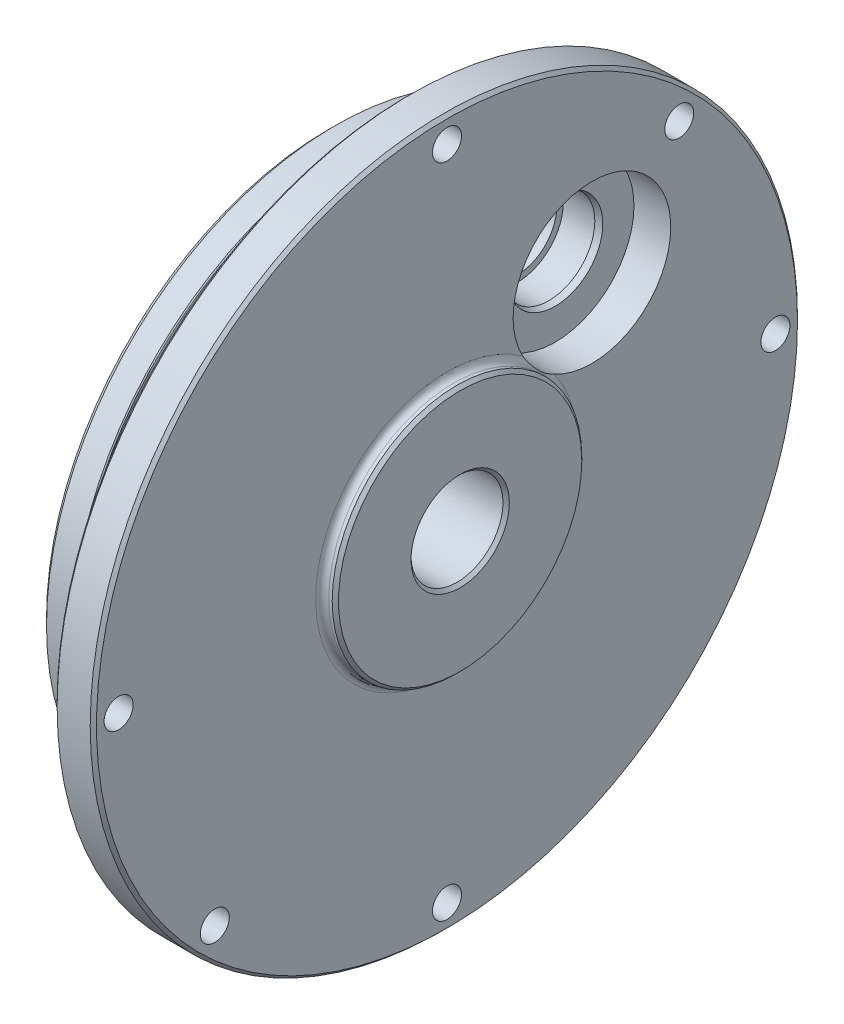
ISO-10303-21;
HEADER;
FILE_DESCRIPTION(('STEP AP214'),'2;1');
FILE_NAME('part.step','',(''),(''),'','','');
FILE_SCHEMA(('AUTOMOTIVE_DESIGN { 1 0 10303 214 1 1 1 1 }'));
ENDSEC;
DATA;
#1=APPLICATION_CONTEXT('core data for automotive mechanical design processes');
#2=APPLICATION_PROTOCOL_DEFINITION('international standard','automotive_design',2000,#1);
#3=PRODUCT_CONTEXT('',#1,'mechanical');
#4=PRODUCT('Part','Part','',(#3));
#5=PRODUCT_RELATED_PRODUCT_CATEGORY('part','',(#4));
#6=PRODUCT_DEFINITION_FORMATION('','',#4);
#7=PRODUCT_DEFINITION_CONTEXT('part definition',#1,'design');
#8=PRODUCT_DEFINITION('design','',#6,#7);
#9=PRODUCT_DEFINITION_SHAPE('','',#8);
#10=(LENGTH_UNIT() NAMED_UNIT(*) SI_UNIT(.MILLI.,.METRE.));
#11=(NAMED_UNIT(*) PLANE_ANGLE_UNIT() SI_UNIT($,.RADIAN.));
#12=(NAMED_UNIT(*) SI_UNIT($,.STERADIAN.) SOLID_ANGLE_UNIT());
#13=UNCERTAINTY_MEASURE_WITH_UNIT(LENGTH_MEASURE(1.E-05),#10,'distance_accuracy_value','');
#14=(GEOMETRIC_REPRESENTATION_CONTEXT(3) GLOBAL_UNCERTAINTY_ASSIGNED_CONTEXT((#13)) GLOBAL_UNIT_ASSIGNED_CONTEXT((#10,
#11,#12)) REPRESENTATION_CONTEXT('',''));
#15=CARTESIAN_POINT('',(0.,0.,0.));
#16=DIRECTION('',(0.,0.,1.));
#17=DIRECTION('',(1.,0.,0.));
#18=AXIS2_PLACEMENT_3D('',#15,#16,#17);
#19=CARTESIAN_POINT('',(15.0749,0.,0.));
#20=DIRECTION('',(-1.,0.,0.));
#21=DIRECTION('',(0.,0.,1.));
#22=AXIS2_PLACEMENT_3D('',#19,#20,#21);
#23=TOROIDAL_SURFACE('',#22,15.86865,0.787400000000001);
#24=CARTESIAN_POINT('',(14.6009713913926,14.057150981017,-8.63495158509178));
#25=CARTESIAN_POINT('',(14.5798328205629,14.0325601259822,-8.64451922023028));
#26=CARTESIAN_POINT('',(14.5601640850397,14.0069828588835,-8.65459249576202));
#27=CARTESIAN_POINT('',(14.5235663697186,13.9543684369931,-8.67559332817284));
#28=CARTESIAN_POINT('',(14.5066303073722,13.9273353065076,-8.6865185641289));
#29=CARTESIAN_POINT('',(14.4598444125726,13.8452730351948,-8.72014783666078));
#30=CARTESIAN_POINT('',(14.4335256889049,13.7886734351264,-8.74393988788284));
#31=CARTESIAN_POINT('',(14.3925838300565,13.683491745751,-8.78941863311359));
#32=CARTESIAN_POINT('',(14.3767256686702,13.6352138480182,-8.81075893789654));
#33=CARTESIAN_POINT('',(14.3494997786954,13.5379705491488,-8.85473686771231));
#34=CARTESIAN_POINT('',(14.338133942262,13.489004867292,-8.87737503481422));
#35=CARTESIAN_POINT('',(14.3191460129198,13.3905416611305,-8.92393158266425));
#36=CARTESIAN_POINT('',(14.3115509541403,13.3410428241516,-8.94785788240117));
#37=CARTESIAN_POINT('',(14.2996380478389,13.2421722083815,-8.99671750456705));
#38=CARTESIAN_POINT('',(14.2953195903333,13.1928004076473,-9.02165063864947));
#39=CARTESIAN_POINT('',(14.2884756519894,13.0777691381543,-9.08101051042028));
#40=CARTESIAN_POINT('',(14.2870465609021,13.012234025526,-9.11580229519625));
#41=CARTESIAN_POINT('',(14.2881964861084,12.8820126826089,-9.18689801701797));
#42=CARTESIAN_POINT('',(14.2907773178194,12.8173268501878,-9.22320263172653));
#43=CARTESIAN_POINT('',(14.3033309432579,12.6246259712907,-9.33433054572981));
#44=CARTESIAN_POINT('',(14.3181209607771,12.4981490403844,-9.41127420571426));
#45=CARTESIAN_POINT('',(14.3554365825578,12.2492781348233,-9.57067959387512));
#46=CARTESIAN_POINT('',(14.3779950326898,12.1269039578394,-9.6531635353199));
#47=CARTESIAN_POINT('',(14.42631933359,11.8866082790783,-9.82333399299739));
#48=CARTESIAN_POINT('',(14.4520834308695,11.7686843886053,-9.91101765136592));
#49=CARTESIAN_POINT('',(14.4981767253612,11.5541672915491,-10.0783675273379));
#50=CARTESIAN_POINT('',(14.5187418104788,11.4570256563188,-10.1572662320137));
#51=CARTESIAN_POINT('',(14.55491725739,11.2653669944242,-10.3193383585005));
#52=CARTESIAN_POINT('',(14.570529000432,11.1708492428053,-10.402510581103));
#53=CARTESIAN_POINT('',(14.5872727706871,11.0313630524024,-10.5302808112137));
#54=CARTESIAN_POINT('',(14.591739453759,10.9853374231413,-10.5732856078839));
#55=CARTESIAN_POINT('',(14.598123632286,10.8940595672357,-10.6602887087338));
#56=CARTESIAN_POINT('',(14.6000414534541,10.8488072425022,-10.704286885241));
#57=CARTESIAN_POINT('',(14.6011557585968,10.7592043443387,-10.7931577972775));
#58=CARTESIAN_POINT('',(14.6003543613644,10.7148530958946,-10.8380298248133));
#59=CARTESIAN_POINT('',(14.5961111073705,10.6271132802999,-10.9285800275613));
#60=CARTESIAN_POINT('',(14.5926691779609,10.5837247396697,-10.9742582249196));
#61=CARTESIAN_POINT('',(14.5796520990526,10.463055295274,-11.1038408927238));
#62=CARTESIAN_POINT('',(14.5673648105531,10.3869564359335,-11.1885743554332));
#63=CARTESIAN_POINT('',(14.5377420511546,10.2382471534765,-11.3602114745736));
#64=CARTESIAN_POINT('',(14.5204033416081,10.1656390032814,-11.447116490483));
#65=CARTESIAN_POINT('',(14.483479958148,10.0234192917324,-11.6236145103684));
#66=CARTESIAN_POINT('',(14.4638842658066,9.95382492859865,-11.7132189757313));
#67=CARTESIAN_POINT('',(14.4249994307004,9.81787195278367,-11.8948647592938));
#68=CARTESIAN_POINT('',(14.4057101798704,9.75151218156105,-11.9869051865009));
#69=CARTESIAN_POINT('',(14.3696572250397,9.62215918891481,-12.1732649120658));
#70=CARTESIAN_POINT('',(14.3528837798405,9.55915362568563,-12.2675736888158));
#71=CARTESIAN_POINT('',(14.3238255819636,9.43620207038486,-12.4589619937246));
#72=CARTESIAN_POINT('',(14.3115436042011,9.37625798936291,-12.5560431949499));
#73=CARTESIAN_POINT('',(14.2938225653538,9.25999304331051,-12.7521733471521));
#74=CARTESIAN_POINT('',(14.2883411576726,9.20365184977508,-12.8512061798053));
#75=CARTESIAN_POINT('',(14.2868348809177,9.09456756987707,-13.0512525533553));
#76=CARTESIAN_POINT('',(14.290794532487,9.04181873944248,-13.1522625831038));
#77=CARTESIAN_POINT('',(14.3055259137087,8.97102109625781,-13.2939295040689));
#78=CARTESIAN_POINT('',(14.3107584300347,8.95120759522785,-13.3342948221256));
#79=CARTESIAN_POINT('',(14.3236213301597,8.91228792381575,-13.4150141433357));
#80=CARTESIAN_POINT('',(14.331252713665,8.89318205204917,-13.4553681347386));
#81=CARTESIAN_POINT('',(14.3492196962482,8.8558460251228,-13.5356675234641));
#82=CARTESIAN_POINT('',(14.3595432535807,8.83761238786049,-13.5756139372596));
#83=CARTESIAN_POINT('',(14.3833061963218,8.80204149848154,-13.6549644442772));
#84=CARTESIAN_POINT('',(14.3967451645059,8.78470412671443,-13.6943686093707));
#85=CARTESIAN_POINT('',(14.4343642157095,8.74315033710193,-13.7905402716815));
#86=CARTESIAN_POINT('',(14.4606269882049,8.71951535797588,-13.846795976134));
#87=CARTESIAN_POINT('',(14.5072321524085,8.68612244668942,-13.9283126451251));
#88=CARTESIAN_POINT('',(14.5240753476179,8.67528404792033,-13.9551384089124));
#89=CARTESIAN_POINT('',(14.5604486926939,8.65444676615417,-14.0073530119022));
#90=CARTESIAN_POINT('',(14.5799855473927,8.64445008154354,-14.0327380351207));
#91=CARTESIAN_POINT('',(14.6009713913925,8.63495158509171,-14.057150981017));
#92=B_SPLINE_CURVE_WITH_KNOTS('',3,(#24,#25,#26,#27,#28,#29,#30,#31,#32,#33,#34,#35,#36,#37,#38,
#39,#40,#41,#42,#43,#44,#45,#46,#47,#48,#49,#50,#51,#52,#53,#54,#55,#56,#57,#58,#59,#60,#61,#62,
#63,#64,#65,#66,#67,#68,#69,#70,#71,#72,#73,#74,#75,#76,#77,#78,#79,#80,#81,#82,#83,#84,#85,#86,
#87,#88,#89,#90,#91),.UNSPECIFIED.,.F.,.F.,(4,2,2,2,2,2,2,2,2,2,2,2,2,2,2,2,2,2,2,2,2,2,2,2,2,2,
2,2,2,2,2,2,2,4),(0.,0.101289256968871,0.20231162225604,0.401942154814138,0.56708410007827,
0.732295528749304,0.898674906691825,1.06502330325715,1.28749169649923,1.51006083748491,
1.95580914411644,2.40346575079253,2.85087855707354,3.23124685067497,3.61150898446447,
3.80089870646978,3.99026422448824,4.17948222431273,4.36870543020958,4.71206622085314,
5.05564763871081,5.400983810968,5.7461953705154,6.09003370528295,6.4340841125403,
6.77598121484699,7.11731813561848,7.25307152632723,7.38888156621041,7.52409426472,
7.65928886561703,7.85780557789531,7.95810844732447,8.05866564777033),.UNSPECIFIED.);
#93=CARTESIAN_POINT('',(14.2875,12.9745918725434,-9.13641168968601));
#94=VERTEX_POINT('',#93);
#95=CARTESIAN_POINT('',(14.2875,9.13641168968597,-12.9745918725434));
#96=VERTEX_POINT('',#95);
#97=EDGE_CURVE('E55',#94,#96,#92,.T.);
#98=ORIENTED_EDGE('',*,*,#97,.F.);
#99=CARTESIAN_POINT('',(14.2875,0.,0.));
#100=DIRECTION('',(-1.,0.,0.));
#101=DIRECTION('',(0.,0.,1.));
#102=AXIS2_PLACEMENT_3D('',#99,#100,#101);
#103=CIRCLE('',#102,15.86865);
#104=EDGE_CURVE('E65',#96,#94,#103,.T.);
#105=ORIENTED_EDGE('',*,*,#104,.F.);
#106=EDGE_LOOP('',(#98,#105));
#107=FACE_BOUND('',#106,.T.);
#108=CARTESIAN_POINT('',(15.0749,0.,0.));
#109=DIRECTION('',(1.,0.,0.));
#110=DIRECTION('',(0.,0.,-1.));
#111=AXIS2_PLACEMENT_3D('',#108,#109,#110);
#112=CIRCLE('',#111,15.08125);
#113=CARTESIAN_POINT('',(15.0749,0.,-15.08125));
#114=VERTEX_POINT('',#113);
#115=EDGE_CURVE('E611',#114,#114,#112,.T.);
#116=ORIENTED_EDGE('',*,*,#115,.F.);
#117=EDGE_LOOP('',(#116));
#118=FACE_BOUND('',#117,.T.);
#119=ADVANCED_FACE('F38',(#107,#118),#23,.F.);
#120=CARTESIAN_POINT('',(14.2875,42.7355,0.));
#121=DIRECTION('',(1.,0.,0.));
#122=DIRECTION('',(0.,0.,-1.));
#123=AXIS2_PLACEMENT_3D('',#120,#121,#122);
#124=PLANE('',#123);
#125=CARTESIAN_POINT('',(14.2875,0.,0.));
#126=DIRECTION('',(1.,0.,0.));
#127=DIRECTION('',(0.,0.,-1.));
#128=AXIS2_PLACEMENT_3D('',#125,#126,#127);
#129=CIRCLE('',#128,42.3545);
#130=CARTESIAN_POINT('',(14.2875,0.,-42.3545));
#131=VERTEX_POINT('',#130);
#132=EDGE_CURVE('E118',#131,#131,#129,.T.);
#133=ORIENTED_EDGE('',*,*,#132,.T.);
#134=EDGE_LOOP('',(#133));
#135=FACE_BOUND('',#134,.T.);
#136=CARTESIAN_POINT('',(14.2875,-28.0633003783411,28.0633003783412));
#137=DIRECTION('',(1.,0.,0.));
#138=DIRECTION('',(0.,0.,-1.));
#139=AXIS2_PLACEMENT_3D('',#136,#137,#138);
#140=CIRCLE('',#139,1.75259999999999);
#141=CARTESIAN_POINT('',(14.2875,-28.0633003783411,26.3107003783412));
#142=VERTEX_POINT('',#141);
#143=EDGE_CURVE('E85',#142,#142,#140,.T.);
#144=ORIENTED_EDGE('',*,*,#143,.F.);
#145=EDGE_LOOP('',(#144));
#146=FACE_BOUND('',#145,.T.);
#147=CARTESIAN_POINT('',(14.2875,28.0633003783411,-28.0633003783412));
#148=DIRECTION('',(1.,0.,0.));
#149=DIRECTION('',(0.,0.,-1.));
#150=AXIS2_PLACEMENT_3D('',#147,#148,#149);
#151=CIRCLE('',#150,1.75259999999999);
#152=CARTESIAN_POINT('',(14.2875,28.0633003783411,-29.8159003783411));
#153=VERTEX_POINT('',#152);
#154=EDGE_CURVE('E283',#153,#153,#151,.T.);
#155=ORIENTED_EDGE('',*,*,#154,.F.);
#156=EDGE_LOOP('',(#155));
#157=FACE_BOUND('',#156,.T.);
#158=CARTESIAN_POINT('',(14.2875,0.,39.6875));
#159=DIRECTION('',(1.,0.,0.));
#160=DIRECTION('',(0.,0.,-1.));
#161=AXIS2_PLACEMENT_3D('',#158,#159,#160);
#162=CIRCLE('',#161,1.75259999999999);
#163=CARTESIAN_POINT('',(14.2875,0.,37.9349));
#164=VERTEX_POINT('',#163);
#165=EDGE_CURVE('E287',#164,#164,#162,.T.);
#166=ORIENTED_EDGE('',*,*,#165,.F.);
#167=EDGE_LOOP('',(#166));
#168=FACE_BOUND('',#167,.T.);
#169=CARTESIAN_POINT('',(14.2875,0.,-39.6875));
#170=DIRECTION('',(1.,0.,0.));
#171=DIRECTION('',(0.,0.,-1.));
#172=AXIS2_PLACEMENT_3D('',#169,#170,#171);
#173=CIRCLE('',#172,1.75259999999999);
#174=CARTESIAN_POINT('',(14.2875,0.,-41.4401));
#175=VERTEX_POINT('',#174);
#176=EDGE_CURVE('E291',#175,#175,#173,.T.);
#177=ORIENTED_EDGE('',*,*,#176,.F.);
#178=EDGE_LOOP('',(#177));
#179=FACE_BOUND('',#178,.T.);
#180=CARTESIAN_POINT('',(14.2875,-39.6875,0.));
#181=DIRECTION('',(1.,0.,0.));
#182=DIRECTION('',(0.,0.,-1.));
#183=AXIS2_PLACEMENT_3D('',#180,#181,#182);
#184=CIRCLE('',#183,1.75259999999999);
#185=CARTESIAN_POINT('',(14.2875,-39.6875,-1.75259999999999));
#186=VERTEX_POINT('',#185);
#187=EDGE_CURVE('E295',#186,#186,#184,.T.);
#188=ORIENTED_EDGE('',*,*,#187,.F.);
#189=EDGE_LOOP('',(#188));
#190=FACE_BOUND('',#189,.T.);
#191=CARTESIAN_POINT('',(14.2875,39.6875,0.));
#192=DIRECTION('',(1.,0.,0.));
#193=DIRECTION('',(0.,0.,-1.));
#194=AXIS2_PLACEMENT_3D('',#191,#192,#193);
#195=CIRCLE('',#194,1.75259999999999);
#196=CARTESIAN_POINT('',(14.2875,39.6875,-1.75259999999999));
#197=VERTEX_POINT('',#196);
#198=EDGE_CURVE('E298',#197,#197,#195,.T.);
#199=ORIENTED_EDGE('',*,*,#198,.F.);
#200=EDGE_LOOP('',(#199));
#201=FACE_BOUND('',#200,.T.);
#202=CARTESIAN_POINT('',(14.2875,17.5114994360848,-17.5114994360849));
#203=DIRECTION('',(1.,0.,0.));
#204=DIRECTION('',(0.,0.,-1.));
#205=AXIS2_PLACEMENT_3D('',#202,#203,#204);
#206=CIRCLE('',#205,9.525);
#207=EDGE_CURVE('E57',#96,#94,#206,.T.);
#208=ORIENTED_EDGE('',*,*,#207,.F.);
#209=ORIENTED_EDGE('',*,*,#104,.T.);
#210=EDGE_LOOP('',(#208,#209));
#211=FACE_BOUND('',#210,.T.);
#212=ADVANCED_FACE('F73',(#135,#146,#157,#168,#179,#190,#201,#211),#124,.T.);
#213=CARTESIAN_POINT('',(15.074925,0.,0.));
#214=DIRECTION('',(-1.,0.,0.));
#215=DIRECTION('',(0.,0.,1.));
#216=AXIS2_PLACEMENT_3D('',#213,#214,#215);
#217=CYLINDRICAL_SURFACE('',#216,42.7355);
#218=CARTESIAN_POINT('',(9.90600000000006,0.,0.));
#219=DIRECTION('',(-1.,0.,0.));
#220=DIRECTION('',(0.,0.,1.));
#221=AXIS2_PLACEMENT_3D('',#218,#219,#220);
#222=CIRCLE('',#221,42.7355);
#223=CARTESIAN_POINT('',(9.90600000000006,0.,42.7355));
#224=VERTEX_POINT('',#223);
#225=EDGE_CURVE('E110',#224,#224,#222,.F.);
#226=ORIENTED_EDGE('',*,*,#225,.T.);
#227=EDGE_LOOP('',(#226));
#228=FACE_BOUND('',#227,.T.);
#229=CARTESIAN_POINT('',(13.9064999999999,0.,0.));
#230=DIRECTION('',(1.,0.,0.));
#231=DIRECTION('',(0.,0.,-1.));
#232=AXIS2_PLACEMENT_3D('',#229,#230,#231);
#233=CIRCLE('',#232,42.7355);
#234=CARTESIAN_POINT('',(13.9064999999999,0.,-42.7355));
#235=VERTEX_POINT('',#234);
#236=EDGE_CURVE('E106',#235,#235,#233,.F.);
#237=ORIENTED_EDGE('',*,*,#236,.T.);
#238=EDGE_LOOP('',(#237));
#239=FACE_BOUND('',#238,.T.);
#240=ADVANCED_FACE('F267',(#228,#239),#217,.T.);
#241=CARTESIAN_POINT('',(9.525,34.8996,0.));
#242=DIRECTION('',(-1.,0.,0.));
#243=DIRECTION('',(0.,0.,1.));
#244=AXIS2_PLACEMENT_3D('',#241,#242,#243);
#245=PLANE('',#244);
#246=CARTESIAN_POINT('',(9.525,0.,0.));
#247=DIRECTION('',(-1.,0.,0.));
#248=DIRECTION('',(0.,0.,1.));
#249=AXIS2_PLACEMENT_3D('',#246,#247,#248);
#250=CIRCLE('',#249,42.3544999999999);
#251=CARTESIAN_POINT('',(9.525,0.,42.3544999999999));
#252=VERTEX_POINT('',#251);
#253=EDGE_CURVE('E102',#252,#252,#250,.T.);
#254=ORIENTED_EDGE('',*,*,#253,.T.);
#255=EDGE_LOOP('',(#254));
#256=FACE_BOUND('',#255,.T.);
#257=CARTESIAN_POINT('',(9.52499999999999,-28.0633003783411,28.0633003783412));
#258=DIRECTION('',(-1.,0.,0.));
#259=DIRECTION('',(0.,0.,1.));
#260=AXIS2_PLACEMENT_3D('',#257,#258,#259);
#261=CIRCLE('',#260,1.75259999999999);
#262=CARTESIAN_POINT('',(9.52499999999999,-28.0633003783411,29.8159003783411));
#263=VERTEX_POINT('',#262);
#264=EDGE_CURVE('E90',#263,#263,#261,.T.);
#265=ORIENTED_EDGE('',*,*,#264,.F.);
#266=EDGE_LOOP('',(#265));
#267=FACE_BOUND('',#266,.T.);
#268=CARTESIAN_POINT('',(9.52499999999999,28.0633003783411,-28.0633003783412));
#269=DIRECTION('',(-1.,0.,0.));
#270=DIRECTION('',(0.,0.,1.));
#271=AXIS2_PLACEMENT_3D('',#268,#269,#270);
#272=CIRCLE('',#271,1.75259999999999);
#273=CARTESIAN_POINT('',(9.52499999999999,28.0633003783411,-26.3107003783412));
#274=VERTEX_POINT('',#273);
#275=EDGE_CURVE('E89',#274,#274,#272,.T.);
#276=ORIENTED_EDGE('',*,*,#275,.F.);
#277=EDGE_LOOP('',(#276));
#278=FACE_BOUND('',#277,.T.);
#279=CARTESIAN_POINT('',(9.52499999999999,0.,39.6875));
#280=DIRECTION('',(-1.,0.,0.));
#281=DIRECTION('',(0.,0.,1.));
#282=AXIS2_PLACEMENT_3D('',#279,#280,#281);
#283=CIRCLE('',#282,1.75259999999999);
#284=CARTESIAN_POINT('',(9.52499999999999,0.,41.4401));
#285=VERTEX_POINT('',#284);
#286=EDGE_CURVE('E632',#285,#285,#283,.T.);
#287=ORIENTED_EDGE('',*,*,#286,.F.);
#288=EDGE_LOOP('',(#287));
#289=FACE_BOUND('',#288,.T.);
#290=CARTESIAN_POINT('',(9.52499999999999,0.,-39.6875));
#291=DIRECTION('',(-1.,0.,0.));
#292=DIRECTION('',(0.,0.,1.));
#293=AXIS2_PLACEMENT_3D('',#290,#291,#292);
#294=CIRCLE('',#293,1.75259999999999);
#295=CARTESIAN_POINT('',(9.52499999999999,0.,-37.9349));
#296=VERTEX_POINT('',#295);
#297=EDGE_CURVE('E636',#296,#296,#294,.T.);
#298=ORIENTED_EDGE('',*,*,#297,.F.);
#299=EDGE_LOOP('',(#298));
#300=FACE_BOUND('',#299,.T.);
#301=CARTESIAN_POINT('',(9.52499999999999,-39.6875,0.));
#302=DIRECTION('',(-1.,0.,0.));
#303=DIRECTION('',(0.,0.,1.));
#304=AXIS2_PLACEMENT_3D('',#301,#302,#303);
#305=CIRCLE('',#304,1.75259999999999);
#306=CARTESIAN_POINT('',(9.52499999999999,-39.6875,1.75259999999999));
#307=VERTEX_POINT('',#306);
#308=EDGE_CURVE('E640',#307,#307,#305,.T.);
#309=ORIENTED_EDGE('',*,*,#308,.F.);
#310=EDGE_LOOP('',(#309));
#311=FACE_BOUND('',#310,.T.);
#312=CARTESIAN_POINT('',(9.52499999999999,39.6875,0.));
#313=DIRECTION('',(-1.,0.,0.));
#314=DIRECTION('',(0.,0.,1.));
#315=AXIS2_PLACEMENT_3D('',#312,#313,#314);
#316=CIRCLE('',#315,1.75259999999999);
#317=CARTESIAN_POINT('',(9.52499999999999,39.6875,1.75259999999999));
#318=VERTEX_POINT('',#317);
#319=EDGE_CURVE('E301',#318,#318,#316,.T.);
#320=ORIENTED_EDGE('',*,*,#319,.F.);
#321=EDGE_LOOP('',(#320));
#322=FACE_BOUND('',#321,.T.);
#323=CARTESIAN_POINT('',(9.525,0.,0.));
#324=DIRECTION('',(-1.,0.,0.));
#325=DIRECTION('',(0.,0.,1.));
#326=AXIS2_PLACEMENT_3D('',#323,#324,#325);
#327=CIRCLE('',#326,34.8996);
#328=CARTESIAN_POINT('',(9.525,0.,34.8996));
#329=VERTEX_POINT('',#328);
#330=EDGE_CURVE('E75',#329,#329,#327,.T.);
#331=ORIENTED_EDGE('',*,*,#330,.F.);
#332=EDGE_LOOP('',(#331));
#333=FACE_BOUND('',#332,.T.);
#334=ADVANCED_FACE('F263',(#256,#267,#278,#289,#300,#311,#322,#333),#245,.T.);
#335=CARTESIAN_POINT('',(15.074925,0.,0.));
#336=DIRECTION('',(-1.,0.,0.));
#337=DIRECTION('',(0.,0.,1.));
#338=AXIS2_PLACEMENT_3D('',#335,#336,#337);
#339=CYLINDRICAL_SURFACE('',#338,34.8996);
#340=CARTESIAN_POINT('',(6.47699999999999,0.,0.));
#341=DIRECTION('',(-1.,0.,0.));
#342=DIRECTION('',(0.,0.,1.));
#343=AXIS2_PLACEMENT_3D('',#340,#341,#342);
#344=CIRCLE('',#343,34.8996);
#345=CARTESIAN_POINT('',(6.47699999999999,0.,34.8996));
#346=VERTEX_POINT('',#345);
#347=EDGE_CURVE('E150',#346,#346,#344,.F.);
#348=ORIENTED_EDGE('',*,*,#347,.T.);
#349=EDGE_LOOP('',(#348));
#350=FACE_BOUND('',#349,.T.);
#351=ORIENTED_EDGE('',*,*,#330,.T.);
#352=EDGE_LOOP('',(#351));
#353=FACE_BOUND('',#352,.T.);
#354=ADVANCED_FACE('F260',(#350,#353),#339,.T.);
#355=CARTESIAN_POINT('',(6.35,33.655,0.));
#356=DIRECTION('',(-1.,0.,0.));
#357=DIRECTION('',(0.,0.,1.));
#358=AXIS2_PLACEMENT_3D('',#355,#356,#357);
#359=PLANE('',#358);
#360=CARTESIAN_POINT('',(6.35,0.,0.));
#361=DIRECTION('',(-1.,0.,0.));
#362=DIRECTION('',(0.,0.,1.));
#363=AXIS2_PLACEMENT_3D('',#360,#361,#362);
#364=CIRCLE('',#363,34.036);
#365=CARTESIAN_POINT('',(6.35,0.,34.036));
#366=VERTEX_POINT('',#365);
#367=EDGE_CURVE('E47',#366,#366,#364,.F.);
#368=ORIENTED_EDGE('',*,*,#367,.T.);
#369=EDGE_LOOP('',(#368));
#370=FACE_BOUND('',#369,.T.);
#371=CARTESIAN_POINT('',(6.35,0.,0.));
#372=DIRECTION('',(-1.,0.,0.));
#373=DIRECTION('',(0.,0.,1.));
#374=AXIS2_PLACEMENT_3D('',#371,#372,#373);
#375=CIRCLE('',#374,34.7726);
#376=CARTESIAN_POINT('',(6.35,0.,34.7726));
#377=VERTEX_POINT('',#376);
#378=EDGE_CURVE('E146',#377,#377,#375,.T.);
#379=ORIENTED_EDGE('',*,*,#378,.T.);
#380=EDGE_LOOP('',(#379));
#381=FACE_BOUND('',#380,.T.);
#382=ADVANCED_FACE('F165',(#370,#381),#359,.T.);
#383=CARTESIAN_POINT('',(15.074925,0.,0.));
#384=DIRECTION('',(-1.,0.,0.));
#385=DIRECTION('',(0.,0.,1.));
#386=AXIS2_PLACEMENT_3D('',#383,#384,#385);
#387=CYLINDRICAL_SURFACE('',#386,33.655);
#388=CARTESIAN_POINT('',(5.96899999999999,0.,0.));
#389=DIRECTION('',(-1.,0.,0.));
#390=DIRECTION('',(0.,0.,1.));
#391=AXIS2_PLACEMENT_3D('',#388,#389,#390);
#392=CIRCLE('',#391,33.655);
#393=CARTESIAN_POINT('',(5.96899999999999,0.,33.655));
#394=VERTEX_POINT('',#393);
#395=EDGE_CURVE('E158',#394,#394,#392,.T.);
#396=ORIENTED_EDGE('',*,*,#395,.T.);
#397=EDGE_LOOP('',(#396));
#398=FACE_BOUND('',#397,.T.);
#399=CARTESIAN_POINT('',(4.318,0.,0.));
#400=DIRECTION('',(1.,0.,0.));
#401=DIRECTION('',(0.,0.,-1.));
#402=AXIS2_PLACEMENT_3D('',#399,#400,#401);
#403=CIRCLE('',#402,33.655);
#404=CARTESIAN_POINT('',(4.318,0.,-33.655));
#405=VERTEX_POINT('',#404);
#406=EDGE_CURVE('E154',#405,#405,#403,.T.);
#407=ORIENTED_EDGE('',*,*,#406,.T.);
#408=EDGE_LOOP('',(#407));
#409=FACE_BOUND('',#408,.T.);
#410=ADVANCED_FACE('F174',(#398,#409),#387,.T.);
#411=CARTESIAN_POINT('',(3.937,34.8996,0.));
#412=DIRECTION('',(1.,0.,0.));
#413=DIRECTION('',(0.,0.,-1.));
#414=AXIS2_PLACEMENT_3D('',#411,#412,#413);
#415=PLANE('',#414);
#416=CARTESIAN_POINT('',(3.937,0.,0.));
#417=DIRECTION('',(1.,0.,0.));
#418=DIRECTION('',(0.,0.,-1.));
#419=AXIS2_PLACEMENT_3D('',#416,#417,#418);
#420=CIRCLE('',#419,34.036);
#421=CARTESIAN_POINT('',(3.937,0.,-34.036));
#422=VERTEX_POINT('',#421);
#423=EDGE_CURVE('E11',#422,#422,#420,.F.);
#424=ORIENTED_EDGE('',*,*,#423,.T.);
#425=EDGE_LOOP('',(#424));
#426=FACE_BOUND('',#425,.T.);
#427=CARTESIAN_POINT('',(3.937,0.,0.));
#428=DIRECTION('',(1.,0.,0.));
#429=DIRECTION('',(0.,0.,-1.));
#430=AXIS2_PLACEMENT_3D('',#427,#428,#429);
#431=CIRCLE('',#430,34.7726);
#432=CARTESIAN_POINT('',(3.937,0.,-34.7726));
#433=VERTEX_POINT('',#432);
#434=EDGE_CURVE('E142',#433,#433,#431,.T.);
#435=ORIENTED_EDGE('',*,*,#434,.T.);
#436=EDGE_LOOP('',(#435));
#437=FACE_BOUND('',#436,.T.);
#438=ADVANCED_FACE('F177',(#426,#437),#415,.T.);
#439=CARTESIAN_POINT('',(15.074925,0.,0.));
#440=DIRECTION('',(-1.,0.,0.));
#441=DIRECTION('',(0.,0.,1.));
#442=AXIS2_PLACEMENT_3D('',#439,#440,#441);
#443=CYLINDRICAL_SURFACE('',#442,34.8996);
#444=CARTESIAN_POINT('',(3.81,0.,0.));
#445=DIRECTION('',(1.,0.,0.));
#446=DIRECTION('',(0.,0.,-1.));
#447=AXIS2_PLACEMENT_3D('',#444,#445,#446);
#448=CIRCLE('',#447,34.8996);
#449=CARTESIAN_POINT('',(3.81,0.,-34.8996));
#450=VERTEX_POINT('',#449);
#451=EDGE_CURVE('E138',#450,#450,#448,.F.);
#452=ORIENTED_EDGE('',*,*,#451,.T.);
#453=EDGE_LOOP('',(#452));
#454=FACE_BOUND('',#453,.T.);
#455=CARTESIAN_POINT('',(0.787400000000086,0.,0.));
#456=DIRECTION('',(-1.,0.,0.));
#457=DIRECTION('',(0.,0.,1.));
#458=AXIS2_PLACEMENT_3D('',#455,#456,#457);
#459=CIRCLE('',#458,34.8996);
#460=CARTESIAN_POINT('',(0.787400000000086,0.,34.8996));
#461=VERTEX_POINT('',#460);
#462=EDGE_CURVE('E134',#461,#461,#459,.F.);
#463=ORIENTED_EDGE('',*,*,#462,.T.);
#464=EDGE_LOOP('',(#463));
#465=FACE_BOUND('',#464,.T.);
#466=ADVANCED_FACE('F187',(#454,#465),#443,.T.);
#467=CARTESIAN_POINT('',(0.,0.,0.));
#468=DIRECTION('',(-1.,0.,0.));
#469=DIRECTION('',(0.,0.,1.));
#470=AXIS2_PLACEMENT_3D('',#467,#468,#469);
#471=PLANE('',#470);
#472=CARTESIAN_POINT('',(0.,0.,0.));
#473=DIRECTION('',(-1.,0.,0.));
#474=DIRECTION('',(0.,0.,1.));
#475=AXIS2_PLACEMENT_3D('',#472,#473,#474);
#476=CIRCLE('',#475,34.1121999999999);
#477=CARTESIAN_POINT('',(0.,0.,34.1121999999999));
#478=VERTEX_POINT('',#477);
#479=EDGE_CURVE('E130',#478,#478,#476,.T.);
#480=ORIENTED_EDGE('',*,*,#479,.T.);
#481=EDGE_LOOP('',(#480));
#482=FACE_BOUND('',#481,.T.);
#483=CARTESIAN_POINT('',(0.,0.,0.));
#484=DIRECTION('',(-1.,0.,0.));
#485=DIRECTION('',(0.,0.,1.));
#486=AXIS2_PLACEMENT_3D('',#483,#484,#485);
#487=CIRCLE('',#486,5.93725000000002);
#488=CARTESIAN_POINT('',(0.,0.,5.93725000000002));
#489=VERTEX_POINT('',#488);
#490=EDGE_CURVE('E64',#489,#489,#487,.F.);
#491=ORIENTED_EDGE('',*,*,#490,.T.);
#492=EDGE_LOOP('',(#491));
#493=FACE_BOUND('',#492,.T.);
#494=CARTESIAN_POINT('',(0.,17.5114994360848,-17.5114994360849));
#495=DIRECTION('',(1.,0.,0.));
#496=DIRECTION('',(0.,0.,-1.));
#497=AXIS2_PLACEMENT_3D('',#494,#495,#496);
#498=CIRCLE('',#497,4.7625);
#499=CARTESIAN_POINT('',(0.,17.5114994360848,-22.2739994360849));
#500=VERTEX_POINT('',#499);
#501=EDGE_CURVE('E71',#500,#500,#498,.T.);
#502=ORIENTED_EDGE('',*,*,#501,.T.);
#503=EDGE_LOOP('',(#502));
#504=FACE_BOUND('',#503,.T.);
#505=ADVANCED_FACE('F200',(#482,#493,#504),#471,.T.);
#506=CARTESIAN_POINT('',(15.494,0.,0.));
#507=DIRECTION('',(-1.,0.,0.));
#508=DIRECTION('',(0.,0.,1.));
#509=AXIS2_PLACEMENT_3D('',#506,#507,#508);
#510=CYLINDRICAL_SURFACE('',#509,15.08125);
#511=CARTESIAN_POINT('',(15.494,0.,0.));
#512=DIRECTION('',(1.,0.,0.));
#513=DIRECTION('',(0.,0.,-1.));
#514=AXIS2_PLACEMENT_3D('',#511,#512,#513);
#515=CIRCLE('',#514,15.08125);
#516=CARTESIAN_POINT('',(15.494,0.,-15.08125));
#517=VERTEX_POINT('',#516);
#518=EDGE_CURVE('E81',#517,#517,#515,.T.);
#519=ORIENTED_EDGE('',*,*,#518,.F.);
#520=EDGE_LOOP('',(#519));
#521=FACE_BOUND('',#520,.T.);
#522=ORIENTED_EDGE('',*,*,#115,.T.);
#523=EDGE_LOOP('',(#522));
#524=FACE_BOUND('',#523,.T.);
#525=ADVANCED_FACE('F212',(#521,#524),#510,.T.);
#526=CARTESIAN_POINT('',(15.494,0.,0.));
#527=DIRECTION('',(-1.,0.,0.));
#528=DIRECTION('',(0.,0.,-1.));
#529=AXIS2_PLACEMENT_3D('',#526,#527,#528);
#530=CONICAL_SURFACE('',#529,15.08125,0.785398163397461);
#531=CARTESIAN_POINT('',(15.875,0.,0.));
#532=DIRECTION('',(1.,0.,0.));
#533=DIRECTION('',(0.,0.,-1.));
#534=AXIS2_PLACEMENT_3D('',#531,#532,#533);
#535=CIRCLE('',#534,14.70025);
#536=CARTESIAN_POINT('',(15.875,0.,-14.70025));
#537=VERTEX_POINT('',#536);
#538=EDGE_CURVE('E70',#537,#537,#535,.T.);
#539=ORIENTED_EDGE('',*,*,#538,.F.);
#540=EDGE_LOOP('',(#539));
#541=FACE_BOUND('',#540,.T.);
#542=ORIENTED_EDGE('',*,*,#518,.T.);
#543=EDGE_LOOP('',(#542));
#544=FACE_BOUND('',#543,.T.);
#545=ADVANCED_FACE('F250',(#541,#544),#530,.T.);
#546=CARTESIAN_POINT('',(15.875,0.,0.));
#547=DIRECTION('',(1.,0.,0.));
#548=DIRECTION('',(0.,0.,-1.));
#549=AXIS2_PLACEMENT_3D('',#546,#547,#548);
#550=PLANE('',#549);
#551=CARTESIAN_POINT('',(15.875,0.,0.));
#552=DIRECTION('',(1.,0.,0.));
#553=DIRECTION('',(0.,0.,-1.));
#554=AXIS2_PLACEMENT_3D('',#551,#552,#553);
#555=CIRCLE('',#554,5.93725000000002);
#556=CARTESIAN_POINT('',(15.875,0.,-5.93725000000002));
#557=VERTEX_POINT('',#556);
#558=EDGE_CURVE('E114',#557,#557,#555,.F.);
#559=ORIENTED_EDGE('',*,*,#558,.T.);
#560=EDGE_LOOP('',(#559));
#561=FACE_BOUND('',#560,.T.);
#562=ORIENTED_EDGE('',*,*,#538,.T.);
#563=EDGE_LOOP('',(#562));
#564=FACE_BOUND('',#563,.T.);
#565=ADVANCED_FACE('F247',(#561,#564),#550,.T.);
#566=CARTESIAN_POINT('',(0.,17.5114994360848,-17.5114994360849));
#567=DIRECTION('',(1.,0.,0.));
#568=DIRECTION('',(0.,0.,-1.));
#569=AXIS2_PLACEMENT_3D('',#566,#567,#568);
#570=CYLINDRICAL_SURFACE('',#569,4.7625);
#571=ORIENTED_EDGE('',*,*,#501,.F.);
#572=EDGE_LOOP('',(#571));
#573=FACE_BOUND('',#572,.T.);
#574=CARTESIAN_POINT('',(5.2705,17.5114994360848,-17.5114994360849));
#575=DIRECTION('',(1.,0.,0.));
#576=DIRECTION('',(0.,0.,-1.));
#577=AXIS2_PLACEMENT_3D('',#574,#575,#576);
#578=CIRCLE('',#577,4.7625);
#579=CARTESIAN_POINT('',(5.2705,17.5114994360848,-22.2739994360849));
#580=VERTEX_POINT('',#579);
#581=EDGE_CURVE('E300',#580,#580,#578,.T.);
#582=ORIENTED_EDGE('',*,*,#581,.T.);
#583=EDGE_LOOP('',(#582));
#584=FACE_BOUND('',#583,.T.);
#585=ADVANCED_FACE('F243',(#573,#584),#570,.F.);
#586=CARTESIAN_POINT('',(0.,17.5114994360848,-17.5114994360849));
#587=DIRECTION('',(1.,0.,0.));
#588=DIRECTION('',(0.,0.,-1.));
#589=AXIS2_PLACEMENT_3D('',#586,#587,#588);
#590=CYLINDRICAL_SURFACE('',#589,9.525);
#591=ORIENTED_EDGE('',*,*,#97,.T.);
#592=ORIENTED_EDGE('',*,*,#207,.T.);
#593=EDGE_LOOP('',(#591,#592));
#594=FACE_BOUND('',#593,.T.);
#595=CARTESIAN_POINT('',(9.8425,17.5114994360848,-17.5114994360849));
#596=DIRECTION('',(1.,0.,0.));
#597=DIRECTION('',(0.,0.,-1.));
#598=AXIS2_PLACEMENT_3D('',#595,#596,#597);
#599=CIRCLE('',#598,9.525);
#600=CARTESIAN_POINT('',(9.8425,17.5114994360848,-27.0364994360849));
#601=VERTEX_POINT('',#600);
#602=EDGE_CURVE('E220',#601,#601,#599,.T.);
#603=ORIENTED_EDGE('',*,*,#602,.F.);
#604=EDGE_LOOP('',(#603));
#605=FACE_BOUND('',#604,.T.);
#606=ADVANCED_FACE('F58',(#594,#605),#590,.F.);
#607=CARTESIAN_POINT('',(9.8425,27.0364994360848,-17.5114994360849));
#608=DIRECTION('',(-1.,0.,0.));
#609=DIRECTION('',(0.,0.,1.));
#610=AXIS2_PLACEMENT_3D('',#607,#608,#609);
#611=PLANE('',#610);
#612=CARTESIAN_POINT('',(9.8425,17.5114994360848,-17.5114994360849));
#613=DIRECTION('',(-1.,0.,0.));
#614=DIRECTION('',(0.,0.,1.));
#615=AXIS2_PLACEMENT_3D('',#612,#613,#614);
#616=CIRCLE('',#615,5.76042728461557);
#617=CARTESIAN_POINT('',(9.8425,17.5114994360848,-11.7510721514693));
#618=VERTEX_POINT('',#617);
#619=EDGE_CURVE('E126',#618,#618,#616,.T.);
#620=ORIENTED_EDGE('',*,*,#619,.T.);
#621=EDGE_LOOP('',(#620));
#622=FACE_BOUND('',#621,.T.);
#623=ORIENTED_EDGE('',*,*,#602,.T.);
#624=EDGE_LOOP('',(#623));
#625=FACE_BOUND('',#624,.T.);
#626=ADVANCED_FACE('F242',(#622,#625),#611,.F.);
#627=CARTESIAN_POINT('',(0.,17.5114994360848,-17.5114994360849));
#628=DIRECTION('',(1.,0.,0.));
#629=DIRECTION('',(0.,0.,-1.));
#630=AXIS2_PLACEMENT_3D('',#627,#628,#629);
#631=CYLINDRICAL_SURFACE('',#630,5.55625);
#632=CARTESIAN_POINT('',(9.08049999999101,17.5114994360848,-17.5114994360849));
#633=DIRECTION('',(-1.,0.,0.));
#634=DIRECTION('',(0.,0.,1.));
#635=AXIS2_PLACEMENT_3D('',#632,#633,#634);
#636=CIRCLE('',#635,5.55625);
#637=CARTESIAN_POINT('',(9.08049999999101,17.5114994360848,-11.9552494360849));
#638=VERTEX_POINT('',#637);
#639=EDGE_CURVE('E122',#638,#638,#636,.F.);
#640=ORIENTED_EDGE('',*,*,#639,.T.);
#641=EDGE_LOOP('',(#640));
#642=FACE_BOUND('',#641,.T.);
#643=CARTESIAN_POINT('',(5.2705,17.5114994360848,-17.5114994360849));
#644=DIRECTION('',(1.,0.,0.));
#645=DIRECTION('',(0.,0.,-1.));
#646=AXIS2_PLACEMENT_3D('',#643,#644,#645);
#647=CIRCLE('',#646,5.55625);
#648=CARTESIAN_POINT('',(5.2705,17.5114994360848,-23.0677494360849));
#649=VERTEX_POINT('',#648);
#650=EDGE_CURVE('E224',#649,#649,#647,.T.);
#651=ORIENTED_EDGE('',*,*,#650,.F.);
#652=EDGE_LOOP('',(#651));
#653=FACE_BOUND('',#652,.T.);
#654=ADVANCED_FACE('F316',(#642,#653),#631,.F.);
#655=CARTESIAN_POINT('',(5.2705,23.0677494360848,-17.5114994360849));
#656=DIRECTION('',(-1.,0.,0.));
#657=DIRECTION('',(0.,0.,1.));
#658=AXIS2_PLACEMENT_3D('',#655,#656,#657);
#659=PLANE('',#658);
#660=ORIENTED_EDGE('',*,*,#581,.F.);
#661=EDGE_LOOP('',(#660));
#662=FACE_BOUND('',#661,.T.);
#663=ORIENTED_EDGE('',*,*,#650,.T.);
#664=EDGE_LOOP('',(#663));
#665=FACE_BOUND('',#664,.T.);
#666=ADVANCED_FACE('F314',(#662,#665),#659,.F.);
#667=CARTESIAN_POINT('',(9.525,39.6875,0.));
#668=DIRECTION('',(-1.,0.,0.));
#669=DIRECTION('',(0.,0.,1.));
#670=AXIS2_PLACEMENT_3D('',#667,#668,#669);
#671=CYLINDRICAL_SURFACE('',#670,1.75259999999999);
#672=ORIENTED_EDGE('',*,*,#198,.T.);
#673=EDGE_LOOP('',(#672));
#674=FACE_BOUND('',#673,.T.);
#675=ORIENTED_EDGE('',*,*,#319,.T.);
#676=EDGE_LOOP('',(#675));
#677=FACE_BOUND('',#676,.T.);
#678=ADVANCED_FACE('F323',(#674,#677),#671,.F.);
#679=CARTESIAN_POINT('',(9.525,-39.6875,0.));
#680=DIRECTION('',(-1.,0.,0.));
#681=DIRECTION('',(0.,0.,1.));
#682=AXIS2_PLACEMENT_3D('',#679,#680,#681);
#683=CYLINDRICAL_SURFACE('',#682,1.75259999999999);
#684=ORIENTED_EDGE('',*,*,#187,.T.);
#685=EDGE_LOOP('',(#684));
#686=FACE_BOUND('',#685,.T.);
#687=ORIENTED_EDGE('',*,*,#308,.T.);
#688=EDGE_LOOP('',(#687));
#689=FACE_BOUND('',#688,.T.);
#690=ADVANCED_FACE('F330',(#686,#689),#683,.F.);
#691=CARTESIAN_POINT('',(9.525,0.,-39.6875));
#692=DIRECTION('',(-1.,0.,0.));
#693=DIRECTION('',(0.,0.,1.));
#694=AXIS2_PLACEMENT_3D('',#691,#692,#693);
#695=CYLINDRICAL_SURFACE('',#694,1.75259999999999);
#696=ORIENTED_EDGE('',*,*,#176,.T.);
#697=EDGE_LOOP('',(#696));
#698=FACE_BOUND('',#697,.T.);
#699=ORIENTED_EDGE('',*,*,#297,.T.);
#700=EDGE_LOOP('',(#699));
#701=FACE_BOUND('',#700,.T.);
#702=ADVANCED_FACE('F333',(#698,#701),#695,.F.);
#703=CARTESIAN_POINT('',(9.525,0.,39.6875));
#704=DIRECTION('',(-1.,0.,0.));
#705=DIRECTION('',(0.,0.,1.));
#706=AXIS2_PLACEMENT_3D('',#703,#704,#705);
#707=CYLINDRICAL_SURFACE('',#706,1.75259999999999);
#708=ORIENTED_EDGE('',*,*,#165,.T.);
#709=EDGE_LOOP('',(#708));
#710=FACE_BOUND('',#709,.T.);
#711=ORIENTED_EDGE('',*,*,#286,.T.);
#712=EDGE_LOOP('',(#711));
#713=FACE_BOUND('',#712,.T.);
#714=ADVANCED_FACE('F337',(#710,#713),#707,.F.);
#715=CARTESIAN_POINT('',(9.525,28.0633003783411,-28.0633003783412));
#716=DIRECTION('',(-1.,0.,0.));
#717=DIRECTION('',(0.,0.,1.));
#718=AXIS2_PLACEMENT_3D('',#715,#716,#717);
#719=CYLINDRICAL_SURFACE('',#718,1.75259999999999);
#720=ORIENTED_EDGE('',*,*,#154,.T.);
#721=EDGE_LOOP('',(#720));
#722=FACE_BOUND('',#721,.T.);
#723=ORIENTED_EDGE('',*,*,#275,.T.);
#724=EDGE_LOOP('',(#723));
#725=FACE_BOUND('',#724,.T.);
#726=ADVANCED_FACE('F341',(#722,#725),#719,.F.);
#727=CARTESIAN_POINT('',(9.525,-28.0633003783411,28.0633003783412));
#728=DIRECTION('',(-1.,0.,0.));
#729=DIRECTION('',(0.,0.,1.));
#730=AXIS2_PLACEMENT_3D('',#727,#728,#729);
#731=CYLINDRICAL_SURFACE('',#730,1.75259999999999);
#732=ORIENTED_EDGE('',*,*,#143,.T.);
#733=EDGE_LOOP('',(#732));
#734=FACE_BOUND('',#733,.T.);
#735=ORIENTED_EDGE('',*,*,#264,.T.);
#736=EDGE_LOOP('',(#735));
#737=FACE_BOUND('',#736,.T.);
#738=ADVANCED_FACE('F345',(#734,#737),#731,.F.);
#739=CARTESIAN_POINT('',(15.875,0.,0.));
#740=DIRECTION('',(1.,0.,0.));
#741=DIRECTION('',(0.,0.,-1.));
#742=AXIS2_PLACEMENT_3D('',#739,#740,#741);
#743=CYLINDRICAL_SURFACE('',#742,5.55624999999999);
#744=CARTESIAN_POINT('',(0.381000000000039,0.,0.));
#745=DIRECTION('',(-1.,0.,0.));
#746=DIRECTION('',(0.,0.,1.));
#747=AXIS2_PLACEMENT_3D('',#744,#745,#746);
#748=CIRCLE('',#747,5.55624999999999);
#749=CARTESIAN_POINT('',(0.381000000000039,0.,5.55624999999999));
#750=VERTEX_POINT('',#749);
#751=EDGE_CURVE('E98',#750,#750,#748,.T.);
#752=ORIENTED_EDGE('',*,*,#751,.T.);
#753=EDGE_LOOP('',(#752));
#754=FACE_BOUND('',#753,.T.);
#755=CARTESIAN_POINT('',(15.494,0.,0.));
#756=DIRECTION('',(1.,0.,0.));
#757=DIRECTION('',(0.,0.,-1.));
#758=AXIS2_PLACEMENT_3D('',#755,#756,#757);
#759=CIRCLE('',#758,5.55624999999999);
#760=CARTESIAN_POINT('',(15.494,0.,-5.55624999999999));
#761=VERTEX_POINT('',#760);
#762=EDGE_CURVE('E94',#761,#761,#759,.T.);
#763=ORIENTED_EDGE('',*,*,#762,.T.);
#764=EDGE_LOOP('',(#763));
#765=FACE_BOUND('',#764,.T.);
#766=ADVANCED_FACE('F349',(#754,#765),#743,.F.);
#767=CARTESIAN_POINT('',(0.,0.,0.));
#768=DIRECTION('',(-1.,0.,0.));
#769=DIRECTION('',(0.,0.,1.));
#770=AXIS2_PLACEMENT_3D('',#767,#768,#769);
#771=CONICAL_SURFACE('',#770,5.93725000000002,0.785398163397444);
#772=ORIENTED_EDGE('',*,*,#751,.F.);
#773=EDGE_LOOP('',(#772));
#774=FACE_BOUND('',#773,.T.);
#775=ORIENTED_EDGE('',*,*,#490,.F.);
#776=EDGE_LOOP('',(#775));
#777=FACE_BOUND('',#776,.T.);
#778=ADVANCED_FACE('F352',(#774,#777),#771,.F.);
#779=CARTESIAN_POINT('',(9.525,0.,0.));
#780=DIRECTION('',(1.,0.,0.));
#781=DIRECTION('',(0.,0.,-1.));
#782=AXIS2_PLACEMENT_3D('',#779,#780,#781);
#783=CONICAL_SURFACE('',#782,42.3544999999999,0.785398163397439);
#784=ORIENTED_EDGE('',*,*,#225,.F.);
#785=EDGE_LOOP('',(#784));
#786=FACE_BOUND('',#785,.T.);
#787=ORIENTED_EDGE('',*,*,#253,.F.);
#788=EDGE_LOOP('',(#787));
#789=FACE_BOUND('',#788,.T.);
#790=ADVANCED_FACE('F357',(#786,#789),#783,.T.);
#791=CARTESIAN_POINT('',(15.494,0.,0.));
#792=DIRECTION('',(1.,0.,0.));
#793=DIRECTION('',(0.,0.,-1.));
#794=AXIS2_PLACEMENT_3D('',#791,#792,#793);
#795=CONICAL_SURFACE('',#794,5.55624999999999,0.785398163397451);
#796=ORIENTED_EDGE('',*,*,#558,.F.);
#797=EDGE_LOOP('',(#796));
#798=FACE_BOUND('',#797,.T.);
#799=ORIENTED_EDGE('',*,*,#762,.F.);
#800=EDGE_LOOP('',(#799));
#801=FACE_BOUND('',#800,.T.);
#802=ADVANCED_FACE('F363',(#798,#801),#795,.F.);
#803=CARTESIAN_POINT('',(13.9064999999999,0.,0.));
#804=DIRECTION('',(-1.,0.,0.));
#805=DIRECTION('',(0.,0.,1.));
#806=AXIS2_PLACEMENT_3D('',#803,#804,#805);
#807=CONICAL_SURFACE('',#806,42.7355,0.785398163397439);
#808=ORIENTED_EDGE('',*,*,#132,.F.);
#809=EDGE_LOOP('',(#808));
#810=FACE_BOUND('',#809,.T.);
#811=ORIENTED_EDGE('',*,*,#236,.F.);
#812=EDGE_LOOP('',(#811));
#813=FACE_BOUND('',#812,.T.);
#814=ADVANCED_FACE('F365',(#810,#813),#807,.T.);
#815=CARTESIAN_POINT('',(9.08049999999101,17.5114994360848,-17.5114994360849));
#816=DIRECTION('',(1.,0.,0.));
#817=DIRECTION('',(0.,0.,-1.));
#818=AXIS2_PLACEMENT_3D('',#815,#816,#817);
#819=CONICAL_SURFACE('',#818,5.55625,0.261799387775457);
#820=ORIENTED_EDGE('',*,*,#619,.F.);
#821=EDGE_LOOP('',(#820));
#822=FACE_BOUND('',#821,.T.);
#823=ORIENTED_EDGE('',*,*,#639,.F.);
#824=EDGE_LOOP('',(#823));
#825=FACE_BOUND('',#824,.T.);
#826=ADVANCED_FACE('F206',(#822,#825),#819,.F.);
#827=CARTESIAN_POINT('',(0.,0.,0.));
#828=DIRECTION('',(1.,0.,0.));
#829=DIRECTION('',(0.,0.,-1.));
#830=AXIS2_PLACEMENT_3D('',#827,#828,#829);
#831=CONICAL_SURFACE('',#830,34.1121999999999,0.785398163397435);
#832=ORIENTED_EDGE('',*,*,#462,.F.);
#833=EDGE_LOOP('',(#832));
#834=FACE_BOUND('',#833,.T.);
#835=ORIENTED_EDGE('',*,*,#479,.F.);
#836=EDGE_LOOP('',(#835));
#837=FACE_BOUND('',#836,.T.);
#838=ADVANCED_FACE('F194',(#834,#837),#831,.T.);
#839=CARTESIAN_POINT('',(3.81,0.,0.));
#840=DIRECTION('',(1.,0.,0.));
#841=DIRECTION('',(0.,0.,-1.));
#842=AXIS2_PLACEMENT_3D('',#839,#840,#841);
#843=TOROIDAL_SURFACE('',#842,34.7726,0.126999999999999);
#844=ORIENTED_EDGE('',*,*,#434,.F.);
#845=EDGE_LOOP('',(#844));
#846=FACE_BOUND('',#845,.T.);
#847=ORIENTED_EDGE('',*,*,#451,.F.);
#848=EDGE_LOOP('',(#847));
#849=FACE_BOUND('',#848,.T.);
#850=ADVANCED_FACE('F191',(#846,#849),#843,.T.);
#851=CARTESIAN_POINT('',(6.47699999999999,0.,0.));
#852=DIRECTION('',(-1.,0.,0.));
#853=DIRECTION('',(0.,0.,1.));
#854=AXIS2_PLACEMENT_3D('',#851,#852,#853);
#855=TOROIDAL_SURFACE('',#854,34.7726,0.126999999999999);
#856=ORIENTED_EDGE('',*,*,#347,.F.);
#857=EDGE_LOOP('',(#856));
#858=FACE_BOUND('',#857,.T.);
#859=ORIENTED_EDGE('',*,*,#378,.F.);
#860=EDGE_LOOP('',(#859));
#861=FACE_BOUND('',#860,.T.);
#862=ADVANCED_FACE('F171',(#858,#861),#855,.T.);
#863=CARTESIAN_POINT('',(5.96899999999999,0.,0.));
#864=DIRECTION('',(-1.,0.,0.));
#865=DIRECTION('',(0.,0.,1.));
#866=AXIS2_PLACEMENT_3D('',#863,#864,#865);
#867=TOROIDAL_SURFACE('',#866,34.036,0.381);
#868=ORIENTED_EDGE('',*,*,#367,.F.);
#869=EDGE_LOOP('',(#868));
#870=FACE_BOUND('',#869,.T.);
#871=ORIENTED_EDGE('',*,*,#395,.F.);
#872=EDGE_LOOP('',(#871));
#873=FACE_BOUND('',#872,.T.);
#874=ADVANCED_FACE('F168',(#870,#873),#867,.F.);
#875=CARTESIAN_POINT('',(4.318,0.,0.));
#876=DIRECTION('',(1.,0.,0.));
#877=DIRECTION('',(0.,0.,-1.));
#878=AXIS2_PLACEMENT_3D('',#875,#876,#877);
#879=TOROIDAL_SURFACE('',#878,34.036,0.381);
#880=ORIENTED_EDGE('',*,*,#406,.F.);
#881=EDGE_LOOP('',(#880));
#882=FACE_BOUND('',#881,.T.);
#883=ORIENTED_EDGE('',*,*,#423,.F.);
#884=EDGE_LOOP('',(#883));
#885=FACE_BOUND('',#884,.T.);
#886=ADVANCED_FACE('F40',(#882,#885),#879,.F.);
#887=CLOSED_SHELL('',(#119,#212,#240,#334,#354,#382,#410,#438,#466,#505,#525,#545,#565,#585,
#606,#626,#654,#666,#678,#690,#702,#714,#726,#738,#766,#778,#790,#802,#814,#826,#838,#850,#862,
#874,#886));
#888=MANIFOLD_SOLID_BREP('B2',#887);
#889=ADVANCED_BREP_SHAPE_REPRESENTATION('',(#18,#888),#14);
#890=SHAPE_DEFINITION_REPRESENTATION(#9,#889);
ENDSEC;
END-ISO-10303-21;
